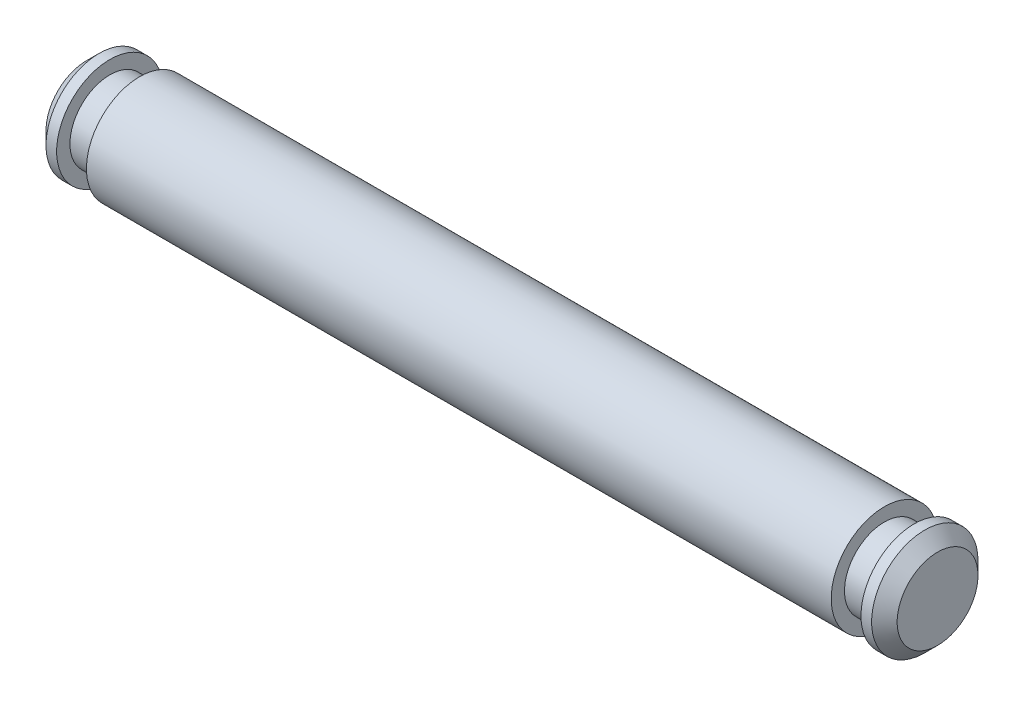
ISO-10303-21;
HEADER;
FILE_DESCRIPTION(('STEP AP214'),'2;1');
FILE_NAME('part.step','',(''),(''),'','','');
FILE_SCHEMA(('AUTOMOTIVE_DESIGN { 1 0 10303 214 1 1 1 1 }'));
ENDSEC;
DATA;
#1=APPLICATION_CONTEXT('core data for automotive mechanical design processes');
#2=APPLICATION_PROTOCOL_DEFINITION('international standard','automotive_design',2000,#1);
#3=PRODUCT_CONTEXT('',#1,'mechanical');
#4=PRODUCT('Part','Part','',(#3));
#5=PRODUCT_RELATED_PRODUCT_CATEGORY('part','',(#4));
#6=PRODUCT_DEFINITION_FORMATION('','',#4);
#7=PRODUCT_DEFINITION_CONTEXT('part definition',#1,'design');
#8=PRODUCT_DEFINITION('design','',#6,#7);
#9=PRODUCT_DEFINITION_SHAPE('','',#8);
#10=(LENGTH_UNIT() NAMED_UNIT(*) SI_UNIT(.MILLI.,.METRE.));
#11=(NAMED_UNIT(*) PLANE_ANGLE_UNIT() SI_UNIT($,.RADIAN.));
#12=(NAMED_UNIT(*) SI_UNIT($,.STERADIAN.) SOLID_ANGLE_UNIT());
#13=UNCERTAINTY_MEASURE_WITH_UNIT(LENGTH_MEASURE(1.E-05),#10,'distance_accuracy_value','');
#14=(GEOMETRIC_REPRESENTATION_CONTEXT(3) GLOBAL_UNCERTAINTY_ASSIGNED_CONTEXT((#13)) GLOBAL_UNIT_ASSIGNED_CONTEXT((#10,
#11,#12)) REPRESENTATION_CONTEXT('',''));
#15=CARTESIAN_POINT('',(0.,0.,0.));
#16=DIRECTION('',(0.,0.,1.));
#17=DIRECTION('',(1.,0.,0.));
#18=AXIS2_PLACEMENT_3D('',#15,#16,#17);
#19=CARTESIAN_POINT('',(0.,2.413,0.));
#20=DIRECTION('',(-1.,0.,0.));
#21=DIRECTION('',(0.,0.,1.));
#22=AXIS2_PLACEMENT_3D('',#19,#20,#21);
#23=PLANE('',#22);
#24=CARTESIAN_POINT('',(0.,0.,0.));
#25=DIRECTION('',(1.,0.,0.));
#26=DIRECTION('',(0.,0.,-1.));
#27=AXIS2_PLACEMENT_3D('',#24,#25,#26);
#28=CIRCLE('',#27,2.413);
#29=CARTESIAN_POINT('',(0.,0.,-2.413));
#30=VERTEX_POINT('',#29);
#31=EDGE_CURVE('E70',#30,#30,#28,.T.);
#32=ORIENTED_EDGE('',*,*,#31,.F.);
#33=EDGE_LOOP('',(#32));
#34=FACE_BOUND('',#33,.T.);
#35=ADVANCED_FACE('F30',(#34),#23,.T.);
#36=CARTESIAN_POINT('',(50.8,0.,0.));
#37=DIRECTION('',(1.,0.,0.));
#38=DIRECTION('',(0.,0.,-1.));
#39=AXIS2_PLACEMENT_3D('',#36,#37,#38);
#40=PLANE('',#39);
#41=CARTESIAN_POINT('',(50.8,0.,0.));
#42=DIRECTION('',(1.,0.,0.));
#43=DIRECTION('',(0.,0.,-1.));
#44=AXIS2_PLACEMENT_3D('',#41,#42,#43);
#45=CIRCLE('',#44,2.413);
#46=CARTESIAN_POINT('',(50.8,0.,-2.413));
#47=VERTEX_POINT('',#46);
#48=EDGE_CURVE('E10',#47,#47,#45,.T.);
#49=ORIENTED_EDGE('',*,*,#48,.T.);
#50=EDGE_LOOP('',(#49));
#51=FACE_BOUND('',#50,.T.);
#52=ADVANCED_FACE('F78',(#51),#40,.T.);
#53=CARTESIAN_POINT('',(50.8,0.,0.));
#54=DIRECTION('',(-1.,0.,0.));
#55=DIRECTION('',(0.,0.,1.));
#56=AXIS2_PLACEMENT_3D('',#53,#54,#55);
#57=CONICAL_SURFACE('',#56,2.413,0.785398163397449);
#58=CARTESIAN_POINT('',(50.038,0.,0.));
#59=DIRECTION('',(1.,0.,0.));
#60=DIRECTION('',(0.,0.,-1.));
#61=AXIS2_PLACEMENT_3D('',#58,#59,#60);
#62=CIRCLE('',#61,3.175);
#63=CARTESIAN_POINT('',(50.038,0.,-3.175));
#64=VERTEX_POINT('',#63);
#65=EDGE_CURVE('E36',#64,#64,#62,.T.);
#66=ORIENTED_EDGE('',*,*,#65,.T.);
#67=EDGE_LOOP('',(#66));
#68=FACE_BOUND('',#67,.T.);
#69=ORIENTED_EDGE('',*,*,#48,.F.);
#70=EDGE_LOOP('',(#69));
#71=FACE_BOUND('',#70,.T.);
#72=ADVANCED_FACE('F82',(#68,#71),#57,.T.);
#73=CARTESIAN_POINT('',(0.,0.,0.));
#74=DIRECTION('',(1.,0.,0.));
#75=DIRECTION('',(0.,0.,-1.));
#76=AXIS2_PLACEMENT_3D('',#73,#74,#75);
#77=CYLINDRICAL_SURFACE('',#76,3.175);
#78=CARTESIAN_POINT('',(49.403,0.,0.));
#79=DIRECTION('',(1.,0.,0.));
#80=DIRECTION('',(0.,0.,-1.));
#81=AXIS2_PLACEMENT_3D('',#78,#79,#80);
#82=CIRCLE('',#81,3.175);
#83=CARTESIAN_POINT('',(49.403,0.,-3.175));
#84=VERTEX_POINT('',#83);
#85=EDGE_CURVE('E40',#84,#84,#82,.T.);
#86=ORIENTED_EDGE('',*,*,#85,.T.);
#87=EDGE_LOOP('',(#86));
#88=FACE_BOUND('',#87,.T.);
#89=ORIENTED_EDGE('',*,*,#65,.F.);
#90=EDGE_LOOP('',(#89));
#91=FACE_BOUND('',#90,.T.);
#92=ADVANCED_FACE('F86',(#88,#91),#77,.T.);
#93=CARTESIAN_POINT('',(49.403,3.175,0.));
#94=DIRECTION('',(-1.,0.,0.));
#95=DIRECTION('',(0.,0.,1.));
#96=AXIS2_PLACEMENT_3D('',#93,#94,#95);
#97=PLANE('',#96);
#98=CARTESIAN_POINT('',(49.403,0.,0.));
#99=DIRECTION('',(1.,0.,0.));
#100=DIRECTION('',(0.,0.,-1.));
#101=AXIS2_PLACEMENT_3D('',#98,#99,#100);
#102=CIRCLE('',#101,2.38125);
#103=CARTESIAN_POINT('',(49.403,0.,-2.38125));
#104=VERTEX_POINT('',#103);
#105=EDGE_CURVE('E44',#104,#104,#102,.T.);
#106=ORIENTED_EDGE('',*,*,#105,.T.);
#107=EDGE_LOOP('',(#106));
#108=FACE_BOUND('',#107,.T.);
#109=ORIENTED_EDGE('',*,*,#85,.F.);
#110=EDGE_LOOP('',(#109));
#111=FACE_BOUND('',#110,.T.);
#112=ADVANCED_FACE('F91',(#108,#111),#97,.T.);
#113=CARTESIAN_POINT('',(0.,0.,0.));
#114=DIRECTION('',(1.,0.,0.));
#115=DIRECTION('',(0.,0.,-1.));
#116=AXIS2_PLACEMENT_3D('',#113,#114,#115);
#117=CYLINDRICAL_SURFACE('',#116,2.38125);
#118=CARTESIAN_POINT('',(47.625,0.,0.));
#119=DIRECTION('',(1.,0.,0.));
#120=DIRECTION('',(0.,0.,-1.));
#121=AXIS2_PLACEMENT_3D('',#118,#119,#120);
#122=CIRCLE('',#121,2.38125);
#123=CARTESIAN_POINT('',(47.625,0.,-2.38125));
#124=VERTEX_POINT('',#123);
#125=EDGE_CURVE('E49',#124,#124,#122,.T.);
#126=ORIENTED_EDGE('',*,*,#125,.T.);
#127=EDGE_LOOP('',(#126));
#128=FACE_BOUND('',#127,.T.);
#129=ORIENTED_EDGE('',*,*,#105,.F.);
#130=EDGE_LOOP('',(#129));
#131=FACE_BOUND('',#130,.T.);
#132=ADVANCED_FACE('F95',(#128,#131),#117,.T.);
#133=CARTESIAN_POINT('',(47.625,2.38125,0.));
#134=DIRECTION('',(1.,0.,0.));
#135=DIRECTION('',(0.,0.,-1.));
#136=AXIS2_PLACEMENT_3D('',#133,#134,#135);
#137=PLANE('',#136);
#138=CARTESIAN_POINT('',(47.625,0.,0.));
#139=DIRECTION('',(1.,0.,0.));
#140=DIRECTION('',(0.,0.,-1.));
#141=AXIS2_PLACEMENT_3D('',#138,#139,#140);
#142=CIRCLE('',#141,3.175);
#143=CARTESIAN_POINT('',(47.625,0.,-3.175));
#144=VERTEX_POINT('',#143);
#145=EDGE_CURVE('E52',#144,#144,#142,.T.);
#146=ORIENTED_EDGE('',*,*,#145,.T.);
#147=EDGE_LOOP('',(#146));
#148=FACE_BOUND('',#147,.T.);
#149=ORIENTED_EDGE('',*,*,#125,.F.);
#150=EDGE_LOOP('',(#149));
#151=FACE_BOUND('',#150,.T.);
#152=ADVANCED_FACE('F99',(#148,#151),#137,.T.);
#153=CARTESIAN_POINT('',(0.,0.,0.));
#154=DIRECTION('',(1.,0.,0.));
#155=DIRECTION('',(0.,0.,-1.));
#156=AXIS2_PLACEMENT_3D('',#153,#154,#155);
#157=CYLINDRICAL_SURFACE('',#156,3.175);
#158=CARTESIAN_POINT('',(3.175,0.,0.));
#159=DIRECTION('',(1.,0.,0.));
#160=DIRECTION('',(0.,0.,-1.));
#161=AXIS2_PLACEMENT_3D('',#158,#159,#160);
#162=CIRCLE('',#161,3.175);
#163=CARTESIAN_POINT('',(3.175,0.,-3.175));
#164=VERTEX_POINT('',#163);
#165=EDGE_CURVE('E55',#164,#164,#162,.T.);
#166=ORIENTED_EDGE('',*,*,#165,.T.);
#167=EDGE_LOOP('',(#166));
#168=FACE_BOUND('',#167,.T.);
#169=ORIENTED_EDGE('',*,*,#145,.F.);
#170=EDGE_LOOP('',(#169));
#171=FACE_BOUND('',#170,.T.);
#172=ADVANCED_FACE('F103',(#168,#171),#157,.T.);
#173=CARTESIAN_POINT('',(3.175,3.175,0.));
#174=DIRECTION('',(-1.,0.,0.));
#175=DIRECTION('',(0.,0.,1.));
#176=AXIS2_PLACEMENT_3D('',#173,#174,#175);
#177=PLANE('',#176);
#178=CARTESIAN_POINT('',(3.175,0.,0.));
#179=DIRECTION('',(1.,0.,0.));
#180=DIRECTION('',(0.,0.,-1.));
#181=AXIS2_PLACEMENT_3D('',#178,#179,#180);
#182=CIRCLE('',#181,2.38125);
#183=CARTESIAN_POINT('',(3.175,0.,-2.38125));
#184=VERTEX_POINT('',#183);
#185=EDGE_CURVE('E58',#184,#184,#182,.T.);
#186=ORIENTED_EDGE('',*,*,#185,.T.);
#187=EDGE_LOOP('',(#186));
#188=FACE_BOUND('',#187,.T.);
#189=ORIENTED_EDGE('',*,*,#165,.F.);
#190=EDGE_LOOP('',(#189));
#191=FACE_BOUND('',#190,.T.);
#192=ADVANCED_FACE('F107',(#188,#191),#177,.T.);
#193=CARTESIAN_POINT('',(0.,0.,0.));
#194=DIRECTION('',(1.,0.,0.));
#195=DIRECTION('',(0.,0.,-1.));
#196=AXIS2_PLACEMENT_3D('',#193,#194,#195);
#197=CYLINDRICAL_SURFACE('',#196,2.38125);
#198=CARTESIAN_POINT('',(1.397,0.,0.));
#199=DIRECTION('',(1.,0.,0.));
#200=DIRECTION('',(0.,0.,-1.));
#201=AXIS2_PLACEMENT_3D('',#198,#199,#200);
#202=CIRCLE('',#201,2.38125);
#203=CARTESIAN_POINT('',(1.397,0.,-2.38125));
#204=VERTEX_POINT('',#203);
#205=EDGE_CURVE('E61',#204,#204,#202,.T.);
#206=ORIENTED_EDGE('',*,*,#205,.T.);
#207=EDGE_LOOP('',(#206));
#208=FACE_BOUND('',#207,.T.);
#209=ORIENTED_EDGE('',*,*,#185,.F.);
#210=EDGE_LOOP('',(#209));
#211=FACE_BOUND('',#210,.T.);
#212=ADVANCED_FACE('F111',(#208,#211),#197,.T.);
#213=CARTESIAN_POINT('',(1.397,2.38125,0.));
#214=DIRECTION('',(1.,0.,0.));
#215=DIRECTION('',(0.,0.,-1.));
#216=AXIS2_PLACEMENT_3D('',#213,#214,#215);
#217=PLANE('',#216);
#218=CARTESIAN_POINT('',(1.397,0.,0.));
#219=DIRECTION('',(1.,0.,0.));
#220=DIRECTION('',(0.,0.,-1.));
#221=AXIS2_PLACEMENT_3D('',#218,#219,#220);
#222=CIRCLE('',#221,3.175);
#223=CARTESIAN_POINT('',(1.397,0.,-3.175));
#224=VERTEX_POINT('',#223);
#225=EDGE_CURVE('E64',#224,#224,#222,.T.);
#226=ORIENTED_EDGE('',*,*,#225,.T.);
#227=EDGE_LOOP('',(#226));
#228=FACE_BOUND('',#227,.T.);
#229=ORIENTED_EDGE('',*,*,#205,.F.);
#230=EDGE_LOOP('',(#229));
#231=FACE_BOUND('',#230,.T.);
#232=ADVANCED_FACE('F115',(#228,#231),#217,.T.);
#233=CARTESIAN_POINT('',(0.,0.,0.));
#234=DIRECTION('',(1.,0.,0.));
#235=DIRECTION('',(0.,0.,-1.));
#236=AXIS2_PLACEMENT_3D('',#233,#234,#235);
#237=CYLINDRICAL_SURFACE('',#236,3.175);
#238=CARTESIAN_POINT('',(0.762,0.,0.));
#239=DIRECTION('',(1.,0.,0.));
#240=DIRECTION('',(0.,0.,-1.));
#241=AXIS2_PLACEMENT_3D('',#238,#239,#240);
#242=CIRCLE('',#241,3.175);
#243=CARTESIAN_POINT('',(0.762,0.,-3.175));
#244=VERTEX_POINT('',#243);
#245=EDGE_CURVE('E67',#244,#244,#242,.T.);
#246=ORIENTED_EDGE('',*,*,#245,.T.);
#247=EDGE_LOOP('',(#246));
#248=FACE_BOUND('',#247,.T.);
#249=ORIENTED_EDGE('',*,*,#225,.F.);
#250=EDGE_LOOP('',(#249));
#251=FACE_BOUND('',#250,.T.);
#252=ADVANCED_FACE('F119',(#248,#251),#237,.T.);
#253=CARTESIAN_POINT('',(0.762,0.,0.));
#254=DIRECTION('',(1.,0.,0.));
#255=DIRECTION('',(0.,0.,-1.));
#256=AXIS2_PLACEMENT_3D('',#253,#254,#255);
#257=CONICAL_SURFACE('',#256,3.175,0.785398163397448);
#258=ORIENTED_EDGE('',*,*,#31,.T.);
#259=EDGE_LOOP('',(#258));
#260=FACE_BOUND('',#259,.T.);
#261=ORIENTED_EDGE('',*,*,#245,.F.);
#262=EDGE_LOOP('',(#261));
#263=FACE_BOUND('',#262,.T.);
#264=ADVANCED_FACE('F74',(#260,#263),#257,.T.);
#265=CLOSED_SHELL('',(#35,#52,#72,#92,#112,#132,#152,#172,#192,#212,#232,#252,#264));
#266=MANIFOLD_SOLID_BREP('B2',#265);
#267=ADVANCED_BREP_SHAPE_REPRESENTATION('',(#18,#266),#14);
#268=SHAPE_DEFINITION_REPRESENTATION(#9,#267);
ENDSEC;
END-ISO-10303-21;
